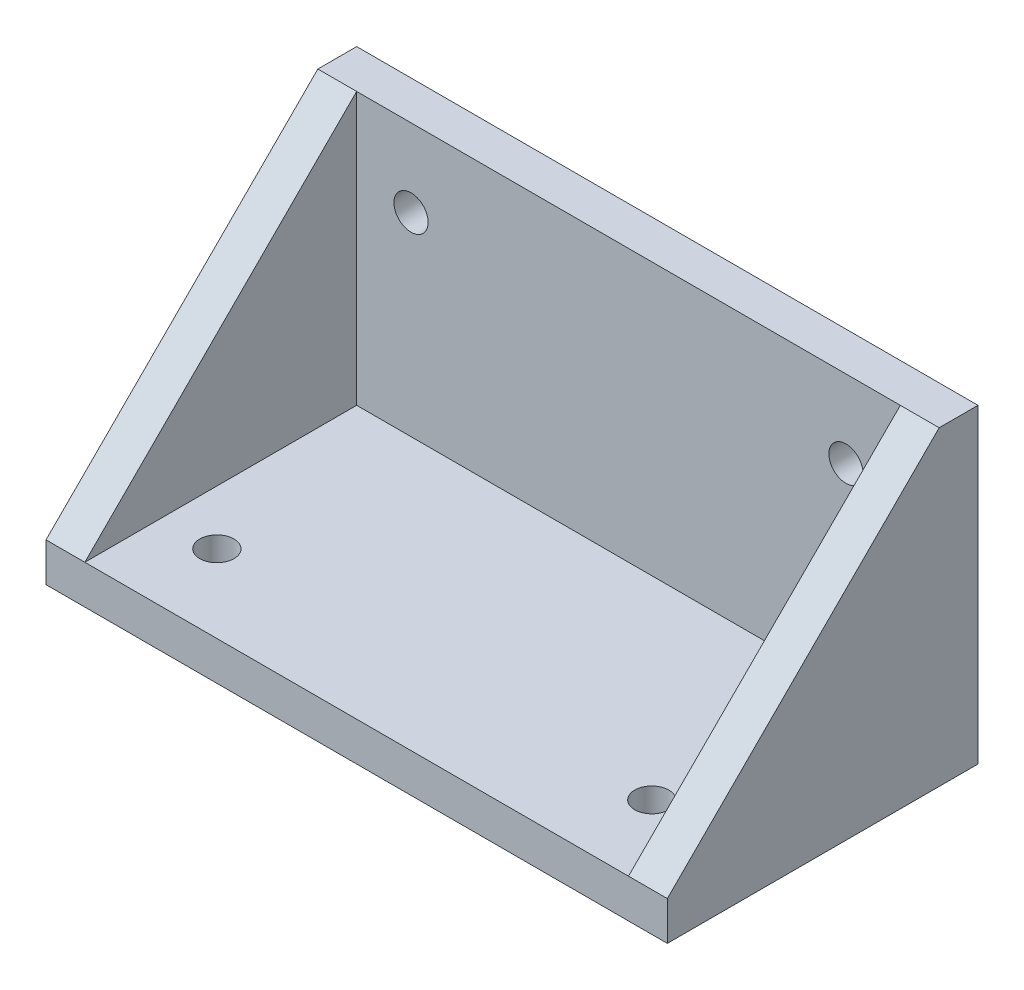
ISO-10303-21;
HEADER;
FILE_DESCRIPTION(('STEP AP214'),'2;1');
FILE_NAME('part.step','',(''),(''),'','','');
FILE_SCHEMA(('AUTOMOTIVE_DESIGN { 1 0 10303 214 1 1 1 1 }'));
ENDSEC;
DATA;
#1=APPLICATION_CONTEXT('core data for automotive mechanical design processes');
#2=APPLICATION_PROTOCOL_DEFINITION('international standard','automotive_design',2000,#1);
#3=PRODUCT_CONTEXT('',#1,'mechanical');
#4=PRODUCT('Part','Part','',(#3));
#5=PRODUCT_RELATED_PRODUCT_CATEGORY('part','',(#4));
#6=PRODUCT_DEFINITION_FORMATION('','',#4);
#7=PRODUCT_DEFINITION_CONTEXT('part definition',#1,'design');
#8=PRODUCT_DEFINITION('design','',#6,#7);
#9=PRODUCT_DEFINITION_SHAPE('','',#8);
#10=(LENGTH_UNIT() NAMED_UNIT(*) SI_UNIT(.MILLI.,.METRE.));
#11=(NAMED_UNIT(*) PLANE_ANGLE_UNIT() SI_UNIT($,.RADIAN.));
#12=(NAMED_UNIT(*) SI_UNIT($,.STERADIAN.) SOLID_ANGLE_UNIT());
#13=UNCERTAINTY_MEASURE_WITH_UNIT(LENGTH_MEASURE(1.E-05),#10,'distance_accuracy_value','');
#14=(GEOMETRIC_REPRESENTATION_CONTEXT(3) GLOBAL_UNCERTAINTY_ASSIGNED_CONTEXT((#13)) GLOBAL_UNIT_ASSIGNED_CONTEXT((#10,
#11,#12)) REPRESENTATION_CONTEXT('',''));
#15=CARTESIAN_POINT('',(0.,0.,0.));
#16=DIRECTION('',(0.,0.,1.));
#17=DIRECTION('',(1.,0.,0.));
#18=AXIS2_PLACEMENT_3D('',#15,#16,#17);
#19=CARTESIAN_POINT('',(0.,5.,0.));
#20=DIRECTION('',(0.,-1.,0.));
#21=DIRECTION('',(0.,0.,-1.));
#22=AXIS2_PLACEMENT_3D('',#19,#20,#21);
#23=PLANE('',#22);
#24=CARTESIAN_POINT('',(-28.,5.,10.));
#25=DIRECTION('',(0.,1.,0.));
#26=DIRECTION('',(0.,0.,1.));
#27=AXIS2_PLACEMENT_3D('',#24,#25,#26);
#28=CIRCLE('',#27,2.2);
#29=CARTESIAN_POINT('',(-28.,5.,12.2));
#30=VERTEX_POINT('',#29);
#31=EDGE_CURVE('E404',#30,#30,#28,.T.);
#32=ORIENTED_EDGE('',*,*,#31,.F.);
#33=EDGE_LOOP('',(#32));
#34=FACE_BOUND('',#33,.T.);
#35=CARTESIAN_POINT('',(28.,5.,10.));
#36=DIRECTION('',(0.,1.,0.));
#37=DIRECTION('',(0.,0.,-1.));
#38=AXIS2_PLACEMENT_3D('',#35,#36,#37);
#39=CIRCLE('',#38,2.2);
#40=CARTESIAN_POINT('',(28.,5.,7.8));
#41=VERTEX_POINT('',#40);
#42=EDGE_CURVE('E408',#41,#41,#39,.T.);
#43=ORIENTED_EDGE('',*,*,#42,.F.);
#44=EDGE_LOOP('',(#43));
#45=FACE_BOUND('',#44,.T.);
#46=DIRECTION('',(1.,0.,0.));
#47=VECTOR('',#46,1.);
#48=CARTESIAN_POINT('',(-40.,5.,20.));
#49=LINE('',#48,#47);
#50=CARTESIAN_POINT('',(-35.,5.,20.));
#51=VERTEX_POINT('',#50);
#52=CARTESIAN_POINT('',(35.,5.,20.));
#53=VERTEX_POINT('',#52);
#54=EDGE_CURVE('E165',#51,#53,#49,.T.);
#55=ORIENTED_EDGE('',*,*,#54,.T.);
#56=DIRECTION('',(0.,0.,-1.));
#57=VECTOR('',#56,1.);
#58=CARTESIAN_POINT('',(35.,5.,20.));
#59=LINE('',#58,#57);
#60=CARTESIAN_POINT('',(35.,5.,-15.));
#61=VERTEX_POINT('',#60);
#62=EDGE_CURVE('E124',#53,#61,#59,.T.);
#63=ORIENTED_EDGE('',*,*,#62,.T.);
#64=DIRECTION('',(1.,0.,0.));
#65=VECTOR('',#64,1.);
#66=CARTESIAN_POINT('',(40.,5.,-15.));
#67=LINE('',#66,#65);
#68=CARTESIAN_POINT('',(-35.,5.,-15.));
#69=VERTEX_POINT('',#68);
#70=EDGE_CURVE('E142',#69,#61,#67,.T.);
#71=ORIENTED_EDGE('',*,*,#70,.F.);
#72=DIRECTION('',(0.,0.,1.));
#73=VECTOR('',#72,1.);
#74=CARTESIAN_POINT('',(-35.,5.,20.));
#75=LINE('',#74,#73);
#76=EDGE_CURVE('E205',#69,#51,#75,.T.);
#77=ORIENTED_EDGE('',*,*,#76,.T.);
#78=EDGE_LOOP('',(#55,#63,#71,#77));
#79=FACE_BOUND('',#78,.T.);
#80=ADVANCED_FACE('F44',(#34,#45,#79),#23,.F.);
#81=CARTESIAN_POINT('',(40.,5.,20.));
#82=DIRECTION('',(-1.,0.,0.));
#83=DIRECTION('',(0.,0.,1.));
#84=AXIS2_PLACEMENT_3D('',#81,#82,#83);
#85=PLANE('',#84);
#86=DIRECTION('',(0.,0.,-1.));
#87=VECTOR('',#86,1.);
#88=CARTESIAN_POINT('',(40.,0.,20.));
#89=LINE('',#88,#87);
#90=CARTESIAN_POINT('',(40.,0.,20.));
#91=VERTEX_POINT('',#90);
#92=CARTESIAN_POINT('',(40.,0.,-20.));
#93=VERTEX_POINT('',#92);
#94=EDGE_CURVE('E153',#91,#93,#89,.T.);
#95=ORIENTED_EDGE('',*,*,#94,.T.);
#96=DIRECTION('',(0.,-1.,0.));
#97=VECTOR('',#96,1.);
#98=CARTESIAN_POINT('',(40.,5.,-20.));
#99=LINE('',#98,#97);
#100=CARTESIAN_POINT('',(40.,40.,-20.));
#101=VERTEX_POINT('',#100);
#102=EDGE_CURVE('E11',#101,#93,#99,.T.);
#103=ORIENTED_EDGE('',*,*,#102,.F.);
#104=DIRECTION('',(0.,0.,-1.));
#105=VECTOR('',#104,1.);
#106=CARTESIAN_POINT('',(40.,40.,-20.));
#107=LINE('',#106,#105);
#108=CARTESIAN_POINT('',(40.,40.,-15.));
#109=VERTEX_POINT('',#108);
#110=EDGE_CURVE('E160',#109,#101,#107,.T.);
#111=ORIENTED_EDGE('',*,*,#110,.F.);
#112=DIRECTION('',(0.,-0.707106781186548,0.707106781186548));
#113=VECTOR('',#112,1.);
#114=CARTESIAN_POINT('',(40.,40.,-15.));
#115=LINE('',#114,#113);
#116=CARTESIAN_POINT('',(40.,5.,20.));
#117=VERTEX_POINT('',#116);
#118=EDGE_CURVE('E117',#109,#117,#115,.T.);
#119=ORIENTED_EDGE('',*,*,#118,.T.);
#120=DIRECTION('',(0.,-1.,0.));
#121=VECTOR('',#120,1.);
#122=CARTESIAN_POINT('',(40.,5.,20.));
#123=LINE('',#122,#121);
#124=EDGE_CURVE('E164',#117,#91,#123,.T.);
#125=ORIENTED_EDGE('',*,*,#124,.T.);
#126=EDGE_LOOP('',(#95,#103,#111,#119,#125));
#127=FACE_BOUND('',#126,.T.);
#128=ADVANCED_FACE('F46',(#127),#85,.F.);
#129=CARTESIAN_POINT('',(-40.,5.,-20.));
#130=DIRECTION('',(0.,0.,1.));
#131=DIRECTION('',(1.,0.,0.));
#132=AXIS2_PLACEMENT_3D('',#129,#130,#131);
#133=PLANE('',#132);
#134=CARTESIAN_POINT('',(-28.,30.,-20.));
#135=DIRECTION('',(0.,0.,1.));
#136=DIRECTION('',(1.,0.,0.));
#137=AXIS2_PLACEMENT_3D('',#134,#135,#136);
#138=CIRCLE('',#137,2.2);
#139=CARTESIAN_POINT('',(-25.8,30.,-20.));
#140=VERTEX_POINT('',#139);
#141=EDGE_CURVE('E394',#140,#140,#138,.T.);
#142=ORIENTED_EDGE('',*,*,#141,.T.);
#143=EDGE_LOOP('',(#142));
#144=FACE_BOUND('',#143,.T.);
#145=CARTESIAN_POINT('',(28.,30.,-20.));
#146=DIRECTION('',(0.,0.,1.));
#147=DIRECTION('',(-1.,0.,0.));
#148=AXIS2_PLACEMENT_3D('',#145,#146,#147);
#149=CIRCLE('',#148,2.2);
#150=CARTESIAN_POINT('',(25.8,30.,-20.));
#151=VERTEX_POINT('',#150);
#152=EDGE_CURVE('E390',#151,#151,#149,.T.);
#153=ORIENTED_EDGE('',*,*,#152,.T.);
#154=EDGE_LOOP('',(#153));
#155=FACE_BOUND('',#154,.T.);
#156=DIRECTION('',(-1.,0.,0.));
#157=VECTOR('',#156,1.);
#158=CARTESIAN_POINT('',(-40.,0.,-20.));
#159=LINE('',#158,#157);
#160=CARTESIAN_POINT('',(-40.,0.,-20.));
#161=VERTEX_POINT('',#160);
#162=EDGE_CURVE('E169',#93,#161,#159,.T.);
#163=ORIENTED_EDGE('',*,*,#162,.T.);
#164=DIRECTION('',(0.,-1.,0.));
#165=VECTOR('',#164,1.);
#166=CARTESIAN_POINT('',(-40.,5.,-20.));
#167=LINE('',#166,#165);
#168=CARTESIAN_POINT('',(-40.,40.,-20.));
#169=VERTEX_POINT('',#168);
#170=EDGE_CURVE('E53',#169,#161,#167,.T.);
#171=ORIENTED_EDGE('',*,*,#170,.F.);
#172=DIRECTION('',(-1.,0.,0.));
#173=VECTOR('',#172,1.);
#174=CARTESIAN_POINT('',(40.,40.,-20.));
#175=LINE('',#174,#173);
#176=EDGE_CURVE('E154',#101,#169,#175,.T.);
#177=ORIENTED_EDGE('',*,*,#176,.F.);
#178=ORIENTED_EDGE('',*,*,#102,.T.);
#179=EDGE_LOOP('',(#163,#171,#177,#178));
#180=FACE_BOUND('',#179,.T.);
#181=ADVANCED_FACE('F220',(#144,#155,#180),#133,.F.);
#182=CARTESIAN_POINT('',(-40.,5.,20.));
#183=DIRECTION('',(1.,0.,0.));
#184=DIRECTION('',(0.,0.,-1.));
#185=AXIS2_PLACEMENT_3D('',#182,#183,#184);
#186=PLANE('',#185);
#187=DIRECTION('',(0.,-1.,0.));
#188=VECTOR('',#187,1.);
#189=CARTESIAN_POINT('',(-40.,5.,20.));
#190=LINE('',#189,#188);
#191=CARTESIAN_POINT('',(-40.,5.,20.));
#192=VERTEX_POINT('',#191);
#193=CARTESIAN_POINT('',(-40.,0.,20.));
#194=VERTEX_POINT('',#193);
#195=EDGE_CURVE('E179',#192,#194,#190,.T.);
#196=ORIENTED_EDGE('',*,*,#195,.F.);
#197=DIRECTION('',(0.,0.707106781186548,-0.707106781186547));
#198=VECTOR('',#197,1.);
#199=CARTESIAN_POINT('',(-40.,40.,-15.));
#200=LINE('',#199,#198);
#201=CARTESIAN_POINT('',(-40.,40.,-15.));
#202=VERTEX_POINT('',#201);
#203=EDGE_CURVE('E201',#192,#202,#200,.T.);
#204=ORIENTED_EDGE('',*,*,#203,.T.);
#205=DIRECTION('',(0.,0.,1.));
#206=VECTOR('',#205,1.);
#207=CARTESIAN_POINT('',(-40.,40.,-20.));
#208=LINE('',#207,#206);
#209=EDGE_CURVE('E149',#169,#202,#208,.T.);
#210=ORIENTED_EDGE('',*,*,#209,.F.);
#211=ORIENTED_EDGE('',*,*,#170,.T.);
#212=DIRECTION('',(0.,0.,1.));
#213=VECTOR('',#212,1.);
#214=CARTESIAN_POINT('',(-40.,0.,20.));
#215=LINE('',#214,#213);
#216=EDGE_CURVE('E172',#161,#194,#215,.T.);
#217=ORIENTED_EDGE('',*,*,#216,.T.);
#218=EDGE_LOOP('',(#196,#204,#210,#211,#217));
#219=FACE_BOUND('',#218,.T.);
#220=ADVANCED_FACE('F187',(#219),#186,.F.);
#221=CARTESIAN_POINT('',(-40.,5.,20.));
#222=DIRECTION('',(0.,0.,-1.));
#223=DIRECTION('',(-1.,0.,0.));
#224=AXIS2_PLACEMENT_3D('',#221,#222,#223);
#225=PLANE('',#224);
#226=DIRECTION('',(1.,0.,0.));
#227=VECTOR('',#226,1.);
#228=CARTESIAN_POINT('',(-40.,0.,20.));
#229=LINE('',#228,#227);
#230=EDGE_CURVE('E68',#194,#91,#229,.T.);
#231=ORIENTED_EDGE('',*,*,#230,.T.);
#232=ORIENTED_EDGE('',*,*,#124,.F.);
#233=DIRECTION('',(1.,0.,0.));
#234=VECTOR('',#233,1.);
#235=CARTESIAN_POINT('',(35.,5.,20.));
#236=LINE('',#235,#234);
#237=EDGE_CURVE('E123',#53,#117,#236,.T.);
#238=ORIENTED_EDGE('',*,*,#237,.F.);
#239=ORIENTED_EDGE('',*,*,#54,.F.);
#240=EDGE_CURVE('E161',#192,#51,#49,.T.);
#241=ORIENTED_EDGE('',*,*,#240,.F.);
#242=ORIENTED_EDGE('',*,*,#195,.T.);
#243=EDGE_LOOP('',(#231,#232,#238,#239,#241,#242));
#244=FACE_BOUND('',#243,.T.);
#245=ADVANCED_FACE('F196',(#244),#225,.F.);
#246=CARTESIAN_POINT('',(0.,0.,0.));
#247=DIRECTION('',(0.,-1.,0.));
#248=DIRECTION('',(0.,0.,-1.));
#249=AXIS2_PLACEMENT_3D('',#246,#247,#248);
#250=PLANE('',#249);
#251=CARTESIAN_POINT('',(-28.,0.,10.));
#252=DIRECTION('',(0.,1.,0.));
#253=DIRECTION('',(0.,0.,1.));
#254=AXIS2_PLACEMENT_3D('',#251,#252,#253);
#255=CIRCLE('',#254,2.2);
#256=CARTESIAN_POINT('',(-28.,0.,12.2));
#257=VERTEX_POINT('',#256);
#258=EDGE_CURVE('E400',#257,#257,#255,.T.);
#259=ORIENTED_EDGE('',*,*,#258,.T.);
#260=EDGE_LOOP('',(#259));
#261=FACE_BOUND('',#260,.T.);
#262=CARTESIAN_POINT('',(28.,0.,10.));
#263=DIRECTION('',(0.,1.,0.));
#264=DIRECTION('',(0.,0.,-1.));
#265=AXIS2_PLACEMENT_3D('',#262,#263,#264);
#266=CIRCLE('',#265,2.2);
#267=CARTESIAN_POINT('',(28.,0.,7.8));
#268=VERTEX_POINT('',#267);
#269=EDGE_CURVE('E412',#268,#268,#266,.T.);
#270=ORIENTED_EDGE('',*,*,#269,.T.);
#271=EDGE_LOOP('',(#270));
#272=FACE_BOUND('',#271,.T.);
#273=ORIENTED_EDGE('',*,*,#94,.F.);
#274=ORIENTED_EDGE('',*,*,#230,.F.);
#275=ORIENTED_EDGE('',*,*,#216,.F.);
#276=ORIENTED_EDGE('',*,*,#162,.F.);
#277=EDGE_LOOP('',(#273,#274,#275,#276));
#278=FACE_BOUND('',#277,.T.);
#279=ADVANCED_FACE('F194',(#261,#272,#278),#250,.T.);
#280=CARTESIAN_POINT('',(40.,40.,-15.));
#281=DIRECTION('',(0.,0.,-1.));
#282=DIRECTION('',(-1.,0.,0.));
#283=AXIS2_PLACEMENT_3D('',#280,#281,#282);
#284=PLANE('',#283);
#285=CARTESIAN_POINT('',(-28.,30.,-15.));
#286=DIRECTION('',(0.,0.,1.));
#287=DIRECTION('',(1.,0.,0.));
#288=AXIS2_PLACEMENT_3D('',#285,#286,#287);
#289=CIRCLE('',#288,2.2);
#290=CARTESIAN_POINT('',(-25.8,30.,-15.));
#291=VERTEX_POINT('',#290);
#292=EDGE_CURVE('E384',#291,#291,#289,.T.);
#293=ORIENTED_EDGE('',*,*,#292,.F.);
#294=EDGE_LOOP('',(#293));
#295=FACE_BOUND('',#294,.T.);
#296=CARTESIAN_POINT('',(28.,30.,-15.));
#297=DIRECTION('',(0.,0.,1.));
#298=DIRECTION('',(-1.,0.,0.));
#299=AXIS2_PLACEMENT_3D('',#296,#297,#298);
#300=CIRCLE('',#299,2.2);
#301=CARTESIAN_POINT('',(25.8,30.,-15.));
#302=VERTEX_POINT('',#301);
#303=EDGE_CURVE('E387',#302,#302,#300,.T.);
#304=ORIENTED_EDGE('',*,*,#303,.F.);
#305=EDGE_LOOP('',(#304));
#306=FACE_BOUND('',#305,.T.);
#307=ORIENTED_EDGE('',*,*,#70,.T.);
#308=DIRECTION('',(0.,1.,0.));
#309=VECTOR('',#308,1.);
#310=CARTESIAN_POINT('',(35.,5.,-15.));
#311=LINE('',#310,#309);
#312=CARTESIAN_POINT('',(35.,40.,-15.));
#313=VERTEX_POINT('',#312);
#314=EDGE_CURVE('E129',#61,#313,#311,.T.);
#315=ORIENTED_EDGE('',*,*,#314,.T.);
#316=DIRECTION('',(1.,0.,0.));
#317=VECTOR('',#316,1.);
#318=CARTESIAN_POINT('',(40.,40.,-15.));
#319=LINE('',#318,#317);
#320=CARTESIAN_POINT('',(-35.,40.,-15.));
#321=VERTEX_POINT('',#320);
#322=EDGE_CURVE('E139',#321,#313,#319,.T.);
#323=ORIENTED_EDGE('',*,*,#322,.F.);
#324=DIRECTION('',(0.,-1.,0.));
#325=VECTOR('',#324,1.);
#326=CARTESIAN_POINT('',(-35.,40.,-15.));
#327=LINE('',#326,#325);
#328=EDGE_CURVE('E209',#321,#69,#327,.T.);
#329=ORIENTED_EDGE('',*,*,#328,.T.);
#330=EDGE_LOOP('',(#307,#315,#323,#329));
#331=FACE_BOUND('',#330,.T.);
#332=ADVANCED_FACE('F137',(#295,#306,#331),#284,.F.);
#333=CARTESIAN_POINT('',(0.,40.,0.));
#334=DIRECTION('',(0.,-1.,0.));
#335=DIRECTION('',(0.,0.,-1.));
#336=AXIS2_PLACEMENT_3D('',#333,#334,#335);
#337=PLANE('',#336);
#338=ORIENTED_EDGE('',*,*,#110,.T.);
#339=ORIENTED_EDGE('',*,*,#176,.T.);
#340=ORIENTED_EDGE('',*,*,#209,.T.);
#341=EDGE_CURVE('E147',#202,#321,#319,.T.);
#342=ORIENTED_EDGE('',*,*,#341,.T.);
#343=ORIENTED_EDGE('',*,*,#322,.T.);
#344=DIRECTION('',(1.,0.,0.));
#345=VECTOR('',#344,1.);
#346=CARTESIAN_POINT('',(35.,40.,-15.));
#347=LINE('',#346,#345);
#348=EDGE_CURVE('E111',#313,#109,#347,.T.);
#349=ORIENTED_EDGE('',*,*,#348,.T.);
#350=EDGE_LOOP('',(#338,#339,#340,#342,#343,#349));
#351=FACE_BOUND('',#350,.T.);
#352=ADVANCED_FACE('F145',(#351),#337,.F.);
#353=CARTESIAN_POINT('',(-35.,40.,-15.));
#354=DIRECTION('',(0.,0.707106781186547,0.707106781186548));
#355=DIRECTION('',(0.,-0.707106781186548,0.707106781186547));
#356=AXIS2_PLACEMENT_3D('',#353,#354,#355);
#357=PLANE('',#356);
#358=ORIENTED_EDGE('',*,*,#203,.F.);
#359=ORIENTED_EDGE('',*,*,#240,.T.);
#360=DIRECTION('',(0.,0.707106781186548,-0.707106781186547));
#361=VECTOR('',#360,1.);
#362=CARTESIAN_POINT('',(-35.,40.,-15.));
#363=LINE('',#362,#361);
#364=EDGE_CURVE('E60',#51,#321,#363,.T.);
#365=ORIENTED_EDGE('',*,*,#364,.T.);
#366=ORIENTED_EDGE('',*,*,#341,.F.);
#367=EDGE_LOOP('',(#358,#359,#365,#366));
#368=FACE_BOUND('',#367,.T.);
#369=ADVANCED_FACE('F261',(#368),#357,.T.);
#370=CARTESIAN_POINT('',(-35.,0.,0.));
#371=DIRECTION('',(1.,0.,0.));
#372=DIRECTION('',(0.,0.,-1.));
#373=AXIS2_PLACEMENT_3D('',#370,#371,#372);
#374=PLANE('',#373);
#375=ORIENTED_EDGE('',*,*,#328,.F.);
#376=ORIENTED_EDGE('',*,*,#364,.F.);
#377=ORIENTED_EDGE('',*,*,#76,.F.);
#378=EDGE_LOOP('',(#375,#376,#377));
#379=FACE_BOUND('',#378,.T.);
#380=ADVANCED_FACE('F269',(#379),#374,.T.);
#381=CARTESIAN_POINT('',(35.,40.,-15.));
#382=DIRECTION('',(0.,0.707106781186548,0.707106781186548));
#383=DIRECTION('',(0.,-0.707106781186548,0.707106781186548));
#384=AXIS2_PLACEMENT_3D('',#381,#382,#383);
#385=PLANE('',#384);
#386=ORIENTED_EDGE('',*,*,#118,.F.);
#387=ORIENTED_EDGE('',*,*,#348,.F.);
#388=DIRECTION('',(0.,-0.707106781186548,0.707106781186548));
#389=VECTOR('',#388,1.);
#390=CARTESIAN_POINT('',(35.,40.,-15.));
#391=LINE('',#390,#389);
#392=EDGE_CURVE('E114',#313,#53,#391,.T.);
#393=ORIENTED_EDGE('',*,*,#392,.T.);
#394=ORIENTED_EDGE('',*,*,#237,.T.);
#395=EDGE_LOOP('',(#386,#387,#393,#394));
#396=FACE_BOUND('',#395,.T.);
#397=ADVANCED_FACE('F113',(#396),#385,.T.);
#398=CARTESIAN_POINT('',(35.,0.,0.));
#399=DIRECTION('',(-1.,0.,0.));
#400=DIRECTION('',(0.,0.,1.));
#401=AXIS2_PLACEMENT_3D('',#398,#399,#400);
#402=PLANE('',#401);
#403=ORIENTED_EDGE('',*,*,#314,.F.);
#404=ORIENTED_EDGE('',*,*,#62,.F.);
#405=ORIENTED_EDGE('',*,*,#392,.F.);
#406=EDGE_LOOP('',(#403,#404,#405));
#407=FACE_BOUND('',#406,.T.);
#408=ADVANCED_FACE('F128',(#407),#402,.T.);
#409=CARTESIAN_POINT('',(28.,0.,10.));
#410=DIRECTION('',(0.,1.,0.));
#411=DIRECTION('',(0.,0.,1.));
#412=AXIS2_PLACEMENT_3D('',#409,#410,#411);
#413=CYLINDRICAL_SURFACE('',#412,2.2);
#414=ORIENTED_EDGE('',*,*,#269,.F.);
#415=EDGE_LOOP('',(#414));
#416=FACE_BOUND('',#415,.T.);
#417=ORIENTED_EDGE('',*,*,#42,.T.);
#418=EDGE_LOOP('',(#417));
#419=FACE_BOUND('',#418,.T.);
#420=ADVANCED_FACE('F276',(#416,#419),#413,.F.);
#421=CARTESIAN_POINT('',(-28.,0.,10.));
#422=DIRECTION('',(0.,1.,0.));
#423=DIRECTION('',(0.,0.,1.));
#424=AXIS2_PLACEMENT_3D('',#421,#422,#423);
#425=CYLINDRICAL_SURFACE('',#424,2.2);
#426=ORIENTED_EDGE('',*,*,#258,.F.);
#427=EDGE_LOOP('',(#426));
#428=FACE_BOUND('',#427,.T.);
#429=ORIENTED_EDGE('',*,*,#31,.T.);
#430=EDGE_LOOP('',(#429));
#431=FACE_BOUND('',#430,.T.);
#432=ADVANCED_FACE('F288',(#428,#431),#425,.F.);
#433=CARTESIAN_POINT('',(28.,30.,-20.));
#434=DIRECTION('',(0.,0.,1.));
#435=DIRECTION('',(1.,0.,0.));
#436=AXIS2_PLACEMENT_3D('',#433,#434,#435);
#437=CYLINDRICAL_SURFACE('',#436,2.2);
#438=ORIENTED_EDGE('',*,*,#152,.F.);
#439=EDGE_LOOP('',(#438));
#440=FACE_BOUND('',#439,.T.);
#441=ORIENTED_EDGE('',*,*,#303,.T.);
#442=EDGE_LOOP('',(#441));
#443=FACE_BOUND('',#442,.T.);
#444=ADVANCED_FACE('F297',(#440,#443),#437,.F.);
#445=CARTESIAN_POINT('',(-28.,30.,-20.));
#446=DIRECTION('',(0.,0.,1.));
#447=DIRECTION('',(1.,0.,0.));
#448=AXIS2_PLACEMENT_3D('',#445,#446,#447);
#449=CYLINDRICAL_SURFACE('',#448,2.2);
#450=ORIENTED_EDGE('',*,*,#141,.F.);
#451=EDGE_LOOP('',(#450));
#452=FACE_BOUND('',#451,.T.);
#453=ORIENTED_EDGE('',*,*,#292,.T.);
#454=EDGE_LOOP('',(#453));
#455=FACE_BOUND('',#454,.T.);
#456=ADVANCED_FACE('F307',(#452,#455),#449,.F.);
#457=CLOSED_SHELL('',(#80,#128,#181,#220,#245,#279,#332,#352,#369,#380,#397,#408,#420,#432,#444,#456));
#458=MANIFOLD_SOLID_BREP('B2',#457);
#459=ADVANCED_BREP_SHAPE_REPRESENTATION('',(#18,#458),#14);
#460=SHAPE_DEFINITION_REPRESENTATION(#9,#459);
ENDSEC;
END-ISO-10303-21;
